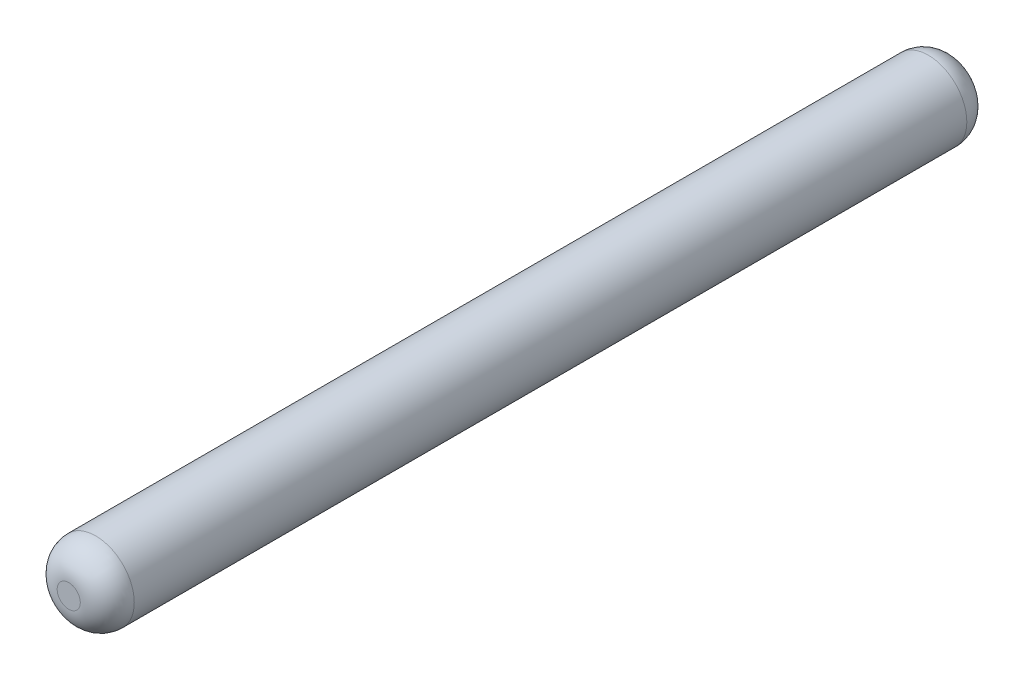
ISO-10303-21;
HEADER;
FILE_DESCRIPTION(('STEP AP214'),'2;1');
FILE_NAME('part.step','',(''),(''),'','','');
FILE_SCHEMA(('AUTOMOTIVE_DESIGN { 1 0 10303 214 1 1 1 1 }'));
ENDSEC;
DATA;
#1=APPLICATION_CONTEXT('core data for automotive mechanical design processes');
#2=APPLICATION_PROTOCOL_DEFINITION('international standard','automotive_design',2000,#1);
#3=PRODUCT_CONTEXT('',#1,'mechanical');
#4=PRODUCT('Part','Part','',(#3));
#5=PRODUCT_RELATED_PRODUCT_CATEGORY('part','',(#4));
#6=PRODUCT_DEFINITION_FORMATION('','',#4);
#7=PRODUCT_DEFINITION_CONTEXT('part definition',#1,'design');
#8=PRODUCT_DEFINITION('design','',#6,#7);
#9=PRODUCT_DEFINITION_SHAPE('','',#8);
#10=(LENGTH_UNIT() NAMED_UNIT(*) SI_UNIT(.MILLI.,.METRE.));
#11=(NAMED_UNIT(*) PLANE_ANGLE_UNIT() SI_UNIT($,.RADIAN.));
#12=(NAMED_UNIT(*) SI_UNIT($,.STERADIAN.) SOLID_ANGLE_UNIT());
#13=UNCERTAINTY_MEASURE_WITH_UNIT(LENGTH_MEASURE(1.E-05),#10,'distance_accuracy_value','');
#14=(GEOMETRIC_REPRESENTATION_CONTEXT(3) GLOBAL_UNCERTAINTY_ASSIGNED_CONTEXT((#13)) GLOBAL_UNIT_ASSIGNED_CONTEXT((#10,
#11,#12)) REPRESENTATION_CONTEXT('',''));
#15=CARTESIAN_POINT('',(0.,0.,0.));
#16=DIRECTION('',(0.,0.,1.));
#17=DIRECTION('',(1.,0.,0.));
#18=AXIS2_PLACEMENT_3D('',#15,#16,#17);
#19=CARTESIAN_POINT('',(0.,0.,23.));
#20=DIRECTION('',(0.,0.,-1.));
#21=DIRECTION('',(-1.,0.,0.));
#22=AXIS2_PLACEMENT_3D('',#19,#20,#21);
#23=CYLINDRICAL_SURFACE('',#22,1.);
#24=CARTESIAN_POINT('',(0.,0.,0.699999999999999));
#25=DIRECTION('',(0.,0.,1.));
#26=DIRECTION('',(1.,0.,0.));
#27=AXIS2_PLACEMENT_3D('',#24,#25,#26);
#28=CIRCLE('',#27,1.);
#29=CARTESIAN_POINT('',(1.,0.,0.699999999999999));
#30=VERTEX_POINT('',#29);
#31=EDGE_CURVE('E43',#30,#30,#28,.T.);
#32=ORIENTED_EDGE('',*,*,#31,.T.);
#33=EDGE_LOOP('',(#32));
#34=FACE_BOUND('',#33,.T.);
#35=CARTESIAN_POINT('',(0.,0.,22.3));
#36=DIRECTION('',(0.,0.,1.));
#37=DIRECTION('',(1.,0.,0.));
#38=AXIS2_PLACEMENT_3D('',#35,#36,#37);
#39=CIRCLE('',#38,1.);
#40=CARTESIAN_POINT('',(1.,0.,22.3));
#41=VERTEX_POINT('',#40);
#42=EDGE_CURVE('E47',#41,#41,#39,.F.);
#43=ORIENTED_EDGE('',*,*,#42,.T.);
#44=EDGE_LOOP('',(#43));
#45=FACE_BOUND('',#44,.T.);
#46=ADVANCED_FACE('F32',(#34,#45),#23,.T.);
#47=CARTESIAN_POINT('',(0.,0.,23.));
#48=DIRECTION('',(0.,0.,1.));
#49=DIRECTION('',(1.,0.,0.));
#50=AXIS2_PLACEMENT_3D('',#47,#48,#49);
#51=PLANE('',#50);
#52=CARTESIAN_POINT('',(0.,0.,23.));
#53=DIRECTION('',(0.,0.,1.));
#54=DIRECTION('',(1.,0.,0.));
#55=AXIS2_PLACEMENT_3D('',#52,#53,#54);
#56=CIRCLE('',#55,0.3);
#57=CARTESIAN_POINT('',(0.3,0.,23.));
#58=VERTEX_POINT('',#57);
#59=EDGE_CURVE('E10',#58,#58,#56,.T.);
#60=ORIENTED_EDGE('',*,*,#59,.T.);
#61=EDGE_LOOP('',(#60));
#62=FACE_BOUND('',#61,.T.);
#63=ADVANCED_FACE('F63',(#62),#51,.T.);
#64=CARTESIAN_POINT('',(0.,0.,0.));
#65=DIRECTION('',(0.,0.,1.));
#66=DIRECTION('',(1.,0.,0.));
#67=AXIS2_PLACEMENT_3D('',#64,#65,#66);
#68=PLANE('',#67);
#69=CARTESIAN_POINT('',(0.,0.,0.));
#70=DIRECTION('',(0.,0.,1.));
#71=DIRECTION('',(1.,0.,0.));
#72=AXIS2_PLACEMENT_3D('',#69,#70,#71);
#73=CIRCLE('',#72,0.3);
#74=CARTESIAN_POINT('',(0.3,0.,0.));
#75=VERTEX_POINT('',#74);
#76=EDGE_CURVE('E39',#75,#75,#73,.F.);
#77=ORIENTED_EDGE('',*,*,#76,.T.);
#78=EDGE_LOOP('',(#77));
#79=FACE_BOUND('',#78,.T.);
#80=ADVANCED_FACE('F60',(#79),#68,.F.);
#81=CARTESIAN_POINT('',(0.,0.,0.699999999999999));
#82=DIRECTION('',(0.,0.,1.));
#83=DIRECTION('',(1.,0.,0.));
#84=AXIS2_PLACEMENT_3D('',#81,#82,#83);
#85=DEGENERATE_TOROIDAL_SURFACE('',#84,0.3,0.7,.T.);
#86=ORIENTED_EDGE('',*,*,#76,.F.);
#87=EDGE_LOOP('',(#86));
#88=FACE_BOUND('',#87,.T.);
#89=ORIENTED_EDGE('',*,*,#31,.F.);
#90=EDGE_LOOP('',(#89));
#91=FACE_BOUND('',#90,.T.);
#92=ADVANCED_FACE('F56',(#88,#91),#85,.T.);
#93=CARTESIAN_POINT('',(0.,0.,22.3));
#94=DIRECTION('',(0.,0.,1.));
#95=DIRECTION('',(1.,0.,0.));
#96=AXIS2_PLACEMENT_3D('',#93,#94,#95);
#97=DEGENERATE_TOROIDAL_SURFACE('',#96,0.3,0.7,.T.);
#98=ORIENTED_EDGE('',*,*,#42,.F.);
#99=EDGE_LOOP('',(#98));
#100=FACE_BOUND('',#99,.T.);
#101=ORIENTED_EDGE('',*,*,#59,.F.);
#102=EDGE_LOOP('',(#101));
#103=FACE_BOUND('',#102,.T.);
#104=ADVANCED_FACE('F34',(#100,#103),#97,.T.);
#105=CLOSED_SHELL('',(#46,#63,#80,#92,#104));
#106=MANIFOLD_SOLID_BREP('B2',#105);
#107=ADVANCED_BREP_SHAPE_REPRESENTATION('',(#18,#106),#14);
#108=SHAPE_DEFINITION_REPRESENTATION(#9,#107);
ENDSEC;
END-ISO-10303-21;
